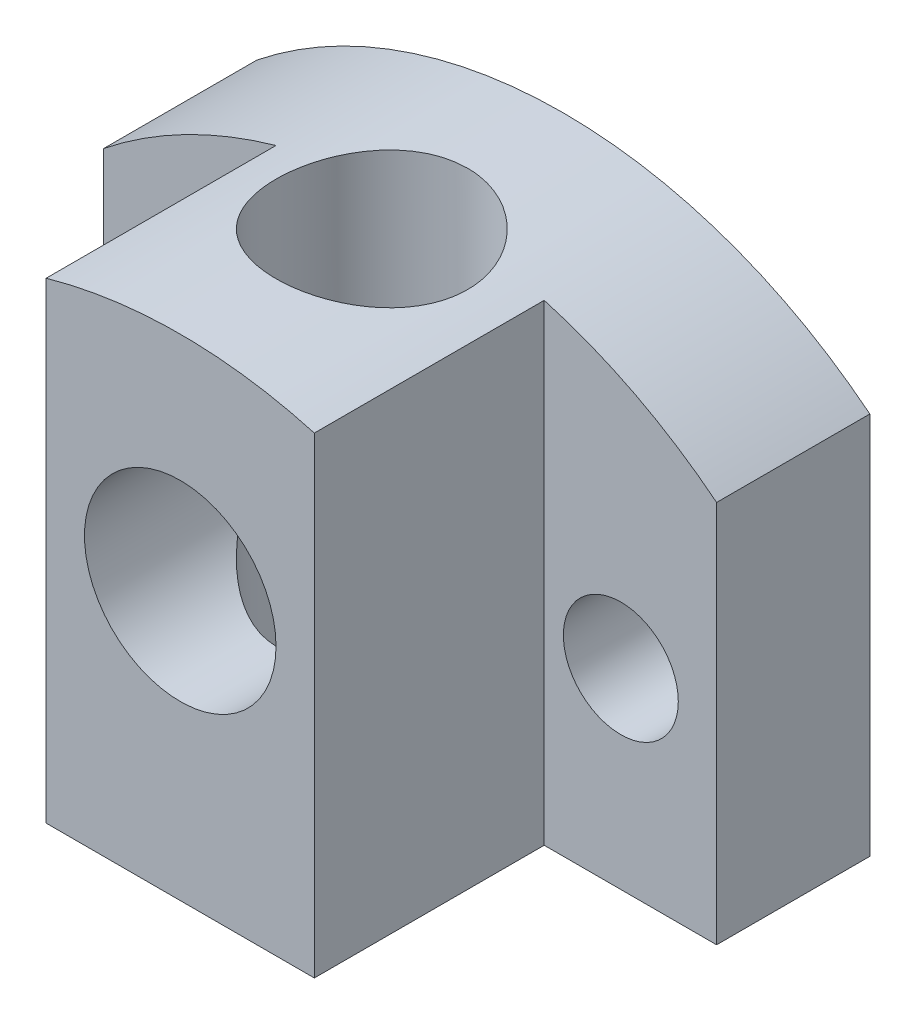
ISO-10303-21;
HEADER;
FILE_DESCRIPTION(('STEP AP214'),'2;1');
FILE_NAME('part.step','',(''),(''),'','','');
FILE_SCHEMA(('AUTOMOTIVE_DESIGN { 1 0 10303 214 1 1 1 1 }'));
ENDSEC;
DATA;
#1=APPLICATION_CONTEXT('core data for automotive mechanical design processes');
#2=APPLICATION_PROTOCOL_DEFINITION('international standard','automotive_design',2000,#1);
#3=PRODUCT_CONTEXT('',#1,'mechanical');
#4=PRODUCT('Part','Part','',(#3));
#5=PRODUCT_RELATED_PRODUCT_CATEGORY('part','',(#4));
#6=PRODUCT_DEFINITION_FORMATION('','',#4);
#7=PRODUCT_DEFINITION_CONTEXT('part definition',#1,'design');
#8=PRODUCT_DEFINITION('design','',#6,#7);
#9=PRODUCT_DEFINITION_SHAPE('','',#8);
#10=(LENGTH_UNIT() NAMED_UNIT(*) SI_UNIT(.MILLI.,.METRE.));
#11=(NAMED_UNIT(*) PLANE_ANGLE_UNIT() SI_UNIT($,.RADIAN.));
#12=(NAMED_UNIT(*) SI_UNIT($,.STERADIAN.) SOLID_ANGLE_UNIT());
#13=UNCERTAINTY_MEASURE_WITH_UNIT(LENGTH_MEASURE(1.E-05),#10,'distance_accuracy_value','');
#14=(GEOMETRIC_REPRESENTATION_CONTEXT(3) GLOBAL_UNCERTAINTY_ASSIGNED_CONTEXT((#13)) GLOBAL_UNIT_ASSIGNED_CONTEXT((#10,
#11,#12)) REPRESENTATION_CONTEXT('',''));
#15=CARTESIAN_POINT('',(0.,0.,0.));
#16=DIRECTION('',(0.,0.,1.));
#17=DIRECTION('',(1.,0.,0.));
#18=AXIS2_PLACEMENT_3D('',#15,#16,#17);
#19=CARTESIAN_POINT('',(0.,0.,-43.4621770797728));
#20=DIRECTION('',(0.,0.,1.));
#21=DIRECTION('',(1.,0.,0.));
#22=AXIS2_PLACEMENT_3D('',#19,#20,#21);
#23=PLANE('',#22);
#24=CARTESIAN_POINT('',(-55.,50.0000000000166,-43.4621770797728));
#25=DIRECTION('',(0.,0.,1.));
#26=DIRECTION('',(1.,0.,0.));
#27=AXIS2_PLACEMENT_3D('',#24,#25,#26);
#28=CIRCLE('',#27,15.);
#29=CARTESIAN_POINT('',(-40.,50.0000000000166,-43.4621770797728));
#30=VERTEX_POINT('',#29);
#31=EDGE_CURVE('E373',#30,#30,#28,.T.);
#32=ORIENTED_EDGE('',*,*,#31,.T.);
#33=EDGE_LOOP('',(#32));
#34=FACE_BOUND('',#33,.T.);
#35=CARTESIAN_POINT('',(0.,70.0000000000166,-43.4621770797728));
#36=DIRECTION('',(0.,0.,1.));
#37=DIRECTION('',(1.,0.,0.));
#38=AXIS2_PLACEMENT_3D('',#35,#36,#37);
#39=CIRCLE('',#38,24.9999999999952);
#40=CARTESIAN_POINT('',(24.9999999999952,70.0000000000166,-43.4621770797728));
#41=VERTEX_POINT('',#40);
#42=EDGE_CURVE('E380',#41,#41,#39,.T.);
#43=ORIENTED_EDGE('',*,*,#42,.T.);
#44=EDGE_LOOP('',(#43));
#45=FACE_BOUND('',#44,.T.);
#46=DIRECTION('',(0.,1.,0.));
#47=VECTOR('',#46,1.);
#48=CARTESIAN_POINT('',(-79.9999999999841,-291432.,-43.4621770797728));
#49=LINE('',#48,#47);
#50=CARTESIAN_POINT('',(-79.9999999999841,1.66206933264434E-11,-43.4621770797728));
#51=VERTEX_POINT('',#50);
#52=CARTESIAN_POINT('',(-79.9999999999792,100.000000000017,-43.4621770797728));
#53=VERTEX_POINT('',#52);
#54=EDGE_CURVE('E136',#51,#53,#49,.T.);
#55=ORIENTED_EDGE('',*,*,#54,.T.);
#56=CARTESIAN_POINT('',(0.,0.,-43.4621770797728));
#57=DIRECTION('',(0.,0.,1.));
#58=DIRECTION('',(1.,0.,0.));
#59=AXIS2_PLACEMENT_3D('',#56,#57,#58);
#60=CIRCLE('',#59,128.062484748657);
#61=CARTESIAN_POINT('',(79.99999999996,100.000000000023,-43.4621770797728));
#62=VERTEX_POINT('',#61);
#63=EDGE_CURVE('E153',#62,#53,#60,.T.);
#64=ORIENTED_EDGE('',*,*,#63,.F.);
#65=DIRECTION('',(0.,1.,0.));
#66=VECTOR('',#65,1.);
#67=CARTESIAN_POINT('',(80.0000000000409,-291432.,-43.4621770797728));
#68=LINE('',#67,#66);
#69=CARTESIAN_POINT('',(79.9999999999841,1.66500848496229E-11,-43.4621770797728));
#70=VERTEX_POINT('',#69);
#71=EDGE_CURVE('E150',#70,#62,#68,.T.);
#72=ORIENTED_EDGE('',*,*,#71,.F.);
#73=DIRECTION('',(1.,0.,0.));
#74=VECTOR('',#73,1.);
#75=CARTESIAN_POINT('',(-400000.,-5.6843418860808E-11,-43.4621770797728));
#76=LINE('',#75,#74);
#77=EDGE_CURVE('E133',#51,#70,#76,.T.);
#78=ORIENTED_EDGE('',*,*,#77,.F.);
#79=EDGE_LOOP('',(#55,#64,#72,#78));
#80=FACE_BOUND('',#79,.T.);
#81=CARTESIAN_POINT('',(55.,50.0000000000166,-43.4621770797728));
#82=DIRECTION('',(0.,0.,-1.));
#83=DIRECTION('',(-1.,0.,0.));
#84=AXIS2_PLACEMENT_3D('',#81,#82,#83);
#85=CIRCLE('',#84,15.);
#86=CARTESIAN_POINT('',(40.,50.0000000000166,-43.4621770797728));
#87=VERTEX_POINT('',#86);
#88=EDGE_CURVE('E374',#87,#87,#85,.T.);
#89=ORIENTED_EDGE('',*,*,#88,.F.);
#90=EDGE_LOOP('',(#89));
#91=FACE_BOUND('',#90,.T.);
#92=ADVANCED_FACE('F35',(#34,#45,#80,#91),#23,.F.);
#93=CARTESIAN_POINT('',(0.,128.063484748657,6.53782292022726));
#94=DIRECTION('',(0.,-1.,0.));
#95=DIRECTION('',(0.,0.,-1.));
#96=AXIS2_PLACEMENT_3D('',#93,#94,#95);
#97=CYLINDRICAL_SURFACE('',#96,25.);
#98=CARTESIAN_POINT('',(0.,70.0000000000166,6.53782292022726));
#99=DIRECTION('',(0.,-0.707106781186547,0.707106781186547));
#100=DIRECTION('',(0.,-0.707106781186547,-0.707106781186547));
#101=AXIS2_PLACEMENT_3D('',#98,#99,#100);
#102=ELLIPSE('',#101,35.355339059324,24.9999999999976);
#103=CARTESIAN_POINT('',(-24.9999999999976,70.0000000000166,6.53782292022726));
#104=VERTEX_POINT('',#103);
#105=CARTESIAN_POINT('',(24.9999999999976,70.0000000000166,6.53782292022726));
#106=VERTEX_POINT('',#105);
#107=EDGE_CURVE('E11',#104,#106,#102,.F.);
#108=ORIENTED_EDGE('',*,*,#107,.F.);
#109=CARTESIAN_POINT('',(0.,70.0000000000166,6.53782292022726));
#110=DIRECTION('',(0.,-0.707106781186547,-0.707106781186547));
#111=DIRECTION('',(0.,-0.707106781186547,0.707106781186547));
#112=AXIS2_PLACEMENT_3D('',#109,#110,#111);
#113=ELLIPSE('',#112,35.355339059324,24.9999999999976);
#114=EDGE_CURVE('E50',#106,#104,#113,.F.);
#115=ORIENTED_EDGE('',*,*,#114,.F.);
#116=EDGE_LOOP('',(#108,#115));
#117=FACE_BOUND('',#116,.T.);
#118=CARTESIAN_POINT('',(0.,128.062484748657,-18.4621770797728));
#119=CARTESIAN_POINT('',(-0.695142082861518,128.062482978419,-18.4621732045668));
#120=CARTESIAN_POINT('',(-1.39037289540682,128.056810158009,-18.4331589718586));
#121=CARTESIAN_POINT('',(-2.77588946733407,128.034271799185,-18.3173154257515));
#122=CARTESIAN_POINT('',(-3.46617434873981,128.017404320987,-18.2304760925474));
#123=CARTESIAN_POINT('',(-4.83729093246203,127.972932342315,-17.9995822454572));
#124=CARTESIAN_POINT('',(-5.51811526521599,127.945319909556,-17.8554854605463));
#125=CARTESIAN_POINT('',(-6.86490655884909,127.880129900468,-17.5112135070664));
#126=CARTESIAN_POINT('',(-7.53087413683484,127.842552738883,-17.3110406724343));
#127=CARTESIAN_POINT('',(-8.84271039499342,127.758514805597,-16.8563630287747));
#128=CARTESIAN_POINT('',(-9.48859731200697,127.712062385543,-16.60190927226));
#129=CARTESIAN_POINT('',(-10.7564948260213,127.611528855701,-16.0404527651775));
#130=CARTESIAN_POINT('',(-11.3785051984394,127.557447674178,-15.7334495204775));
#131=CARTESIAN_POINT('',(-12.5943900989995,127.443141131267,-15.0691485768393));
#132=CARTESIAN_POINT('',(-13.1882671818441,127.382916329336,-14.7118554563253));
#133=CARTESIAN_POINT('',(-14.3439967631095,127.257957141653,-13.9494660351384));
#134=CARTESIAN_POINT('',(-14.9058490258169,127.193222722718,-13.5443693826828));
#135=CARTESIAN_POINT('',(-16.0001316289553,127.060234286875,-12.6841884188186));
#136=CARTESIAN_POINT('',(-16.5321454840914,126.991948172876,-12.2285791541892));
#137=CARTESIAN_POINT('',(-17.556026148482,126.854455297319,-11.274410227961));
#138=CARTESIAN_POINT('',(-18.0478926424083,126.785248528536,-10.7758502290788));
#139=CARTESIAN_POINT('',(-18.9881787450439,126.647838135764,-9.73911893206214));
#140=CARTESIAN_POINT('',(-19.4365951672711,126.579634585659,-9.20094473384059));
#141=CARTESIAN_POINT('',(-20.286857549835,126.446149286729,-8.08864125804648));
#142=CARTESIAN_POINT('',(-20.6887033785642,126.38086754616,-7.51451187887222));
#143=CARTESIAN_POINT('',(-21.4462686778638,126.254530096283,-6.32905783958681));
#144=CARTESIAN_POINT('',(-21.8015587555404,126.193515860265,-5.71745422719115));
#145=CARTESIAN_POINT('',(-22.4592767301321,126.078120361726,-4.46584320392627));
#146=CARTESIAN_POINT('',(-22.7617042341733,126.023739148502,-3.82583558200312));
#147=CARTESIAN_POINT('',(-23.3113842249958,125.923220586728,-2.52197140749639));
#148=CARTESIAN_POINT('',(-23.5586407360225,125.877082636953,-1.85811659846188));
#149=CARTESIAN_POINT('',(-23.9960726685231,125.794427933921,-0.511276667932535));
#150=CARTESIAN_POINT('',(-24.1862488989453,125.757911044315,0.171708182299098));
#151=CARTESIAN_POINT('',(-24.5059839235942,125.695994207394,1.54319203448165));
#152=CARTESIAN_POINT('',(-24.636271089232,125.670460936754,2.23151524411565));
#153=CARTESIAN_POINT('',(-24.8386557959202,125.630616676781,3.61698664391357));
#154=CARTESIAN_POINT('',(-24.9107537744733,125.616305603073,4.31413476768621));
#155=CARTESIAN_POINT('',(-24.9961707955821,125.599336584983,5.71210457939389));
#156=CARTESIAN_POINT('',(-25.0094948616772,125.596677644667,6.41292594824177));
#157=CARTESIAN_POINT('',(-24.9772683408429,125.603090477354,7.81315656380167));
#158=CARTESIAN_POINT('',(-24.9317182217551,125.61216215714,8.51256582169075));
#159=CARTESIAN_POINT('',(-24.7831925981942,125.641549545886,9.8948473271222));
#160=CARTESIAN_POINT('',(-24.6810508564899,125.661701970581,10.5778128368491));
#161=CARTESIAN_POINT('',(-24.4207383803839,125.712549482808,11.9325716718318));
#162=CARTESIAN_POINT('',(-24.2625682639061,125.743244454069,12.6043651202161));
#163=CARTESIAN_POINT('',(-23.8914100996149,125.814292439109,13.9321264502291));
#164=CARTESIAN_POINT('',(-23.6784203236259,125.854645757363,14.5880938322318));
#165=CARTESIAN_POINT('',(-23.1992223544499,125.943858243269,15.8796943991677));
#166=CARTESIAN_POINT('',(-22.9330136351488,125.992717495009,16.515327383006));
#167=CARTESIAN_POINT('',(-22.3474344236412,126.097903168625,17.7660026798394));
#168=CARTESIAN_POINT('',(-22.0277320139128,126.154275734697,18.3808856817457));
#169=CARTESIAN_POINT('',(-21.33867673783,126.272653478459,19.5815958751439));
#170=CARTESIAN_POINT('',(-20.9693237446488,126.334658670538,20.1674229924105));
#171=CARTESIAN_POINT('',(-20.1835012960738,126.462582198814,21.3061979725471));
#172=CARTESIAN_POINT('',(-19.7670274983472,126.528500895386,21.859142798034));
#173=CARTESIAN_POINT('',(-18.8898171568486,126.662431725247,22.9284623212855));
#174=CARTESIAN_POINT('',(-18.4290800936583,126.730443883096,23.4448365897805));
#175=CARTESIAN_POINT('',(-17.4581593027275,126.867872584864,24.4461246787433));
#176=CARTESIAN_POINT('',(-16.9472635873703,126.937293224142,24.9303478196962));
#177=CARTESIAN_POINT('',(-15.8863366761298,127.074428343463,25.854112557109));
#178=CARTESIAN_POINT('',(-15.3363050136345,127.142142803151,26.2936536206792));
#179=CARTESIAN_POINT('',(-14.2008397778708,127.273967296325,27.1249851375913));
#180=CARTESIAN_POINT('',(-13.6154055749307,127.338077265663,27.5167747412489));
#181=CARTESIAN_POINT('',(-12.4131504397087,127.460891083495,28.24978666438));
#182=CARTESIAN_POINT('',(-11.7963296431051,127.519594955356,28.5910092024205));
#183=CARTESIAN_POINT('',(-10.5346490231888,127.630022705466,29.2208344293476));
#184=CARTESIAN_POINT('',(-9.88974978693469,127.681736324803,29.5093599933413));
#185=CARTESIAN_POINT('',(-8.57729359898651,127.77661313472,30.0309854435001));
#186=CARTESIAN_POINT('',(-7.90973658068292,127.819776300161,30.2640851667079));
#187=CARTESIAN_POINT('',(-6.55682080978695,127.896313763854,30.6730140290131));
#188=CARTESIAN_POINT('',(-5.87146373711444,127.929688982237,30.8488485515871));
#189=CARTESIAN_POINT('',(-4.48789378799971,127.985694907965,31.1418635943263));
#190=CARTESIAN_POINT('',(-3.78968109999598,128.00832577267,31.2590449735248));
#191=CARTESIAN_POINT('',(-2.39678381821483,128.041918861153,31.432402574303));
#192=CARTESIAN_POINT('',(-1.7022209990307,128.053061687836,31.4895233008756));
#193=CARTESIAN_POINT('',(-0.310665193128561,128.063998050827,31.5455890016789));
#194=CARTESIAN_POINT('',(0.386327767693641,128.063791707704,31.5445345939459));
#195=CARTESIAN_POINT('',(1.77766053277306,128.052035906764,31.4842608432675));
#196=CARTESIAN_POINT('',(2.47200046824215,128.040487017406,31.4250444152478));
#197=CARTESIAN_POINT('',(3.85304846478161,128.006371498756,31.2489255500687));
#198=CARTESIAN_POINT('',(4.53975653985763,127.983804889687,31.13202321879));
#199=CARTESIAN_POINT('',(5.89480186659541,127.928523894682,30.8427026332368));
#200=CARTESIAN_POINT('',(6.56324597582421,127.895897901422,30.6707674740747));
#201=CARTESIAN_POINT('',(7.88315548645323,127.821331640882,30.2724194019364));
#202=CARTESIAN_POINT('',(8.53462101601188,127.77939144393,30.0460069003006));
#203=CARTESIAN_POINT('',(9.81616314911559,127.687335784598,29.54037663083));
#204=CARTESIAN_POINT('',(10.446238588142,127.637219877975,29.2611559934367));
#205=CARTESIAN_POINT('',(11.6807397391199,127.530169947033,28.65193881666));
#206=CARTESIAN_POINT('',(12.28516513957,127.473235839944,28.3219416608568));
#207=CARTESIAN_POINT('',(13.4712893378523,127.353381886924,27.6093352889114));
#208=CARTESIAN_POINT('',(14.0526383035739,127.290399651372,27.226154235938));
#209=CARTESIAN_POINT('',(15.18110089043,127.160751835001,26.4128801801415));
#210=CARTESIAN_POINT('',(15.7282142832161,127.09408622962,25.9827868644699));
#211=CARTESIAN_POINT('',(16.7846157755035,126.958892265289,25.0785915814902));
#212=CARTESIAN_POINT('',(17.293900491175,126.890363740445,24.6044856857067));
#213=CARTESIAN_POINT('',(18.2712005282584,126.753330424187,23.6154852937749));
#214=CARTESIAN_POINT('',(18.7392155094141,126.684825632974,23.1005904614009));
#215=CARTESIAN_POINT('',(19.6372884640126,126.548750314769,22.0257034811798));
#216=CARTESIAN_POINT('',(20.0666983758884,126.481207697208,21.4651660977242));
#217=CARTESIAN_POINT('',(20.8767747624981,126.350024565292,20.3094694003178));
#218=CARTESIAN_POINT('',(21.2574407042479,126.286384093608,19.7143097078976));
#219=CARTESIAN_POINT('',(21.9672655247039,126.164848368064,18.493482308751));
#220=CARTESIAN_POINT('',(22.2964256896729,126.106952970745,17.8678153643995));
#221=CARTESIAN_POINT('',(22.9007970142529,125.998602421953,16.5903247143801));
#222=CARTESIAN_POINT('',(23.1760086844594,125.948147200065,15.9385012563409));
#223=CARTESIAN_POINT('',(23.6691102938166,125.85640960745,14.6166995267246));
#224=CARTESIAN_POINT('',(23.8872857851738,125.815081708816,13.9468309668389));
#225=CARTESIAN_POINT('',(24.2664418872206,125.742503172393,12.5905573779477));
#226=CARTESIAN_POINT('',(24.4274226026042,125.711252516157,11.9041523792144));
#227=CARTESIAN_POINT('',(24.6908824575003,125.659772281882,10.5198680808322));
#228=CARTESIAN_POINT('',(24.7933676683401,125.639541560079,9.82198997973021));
#229=CARTESIAN_POINT('',(24.9390220791946,125.610710997051,8.41983530009437));
#230=CARTESIAN_POINT('',(24.9821920751776,125.602110999749,7.71555880755004));
#231=CARTESIAN_POINT('',(25.0086321665234,125.59684897522,6.31802196375232));
#232=CARTESIAN_POINT('',(24.9929242291417,125.599983270174,5.62478150093845));
#233=CARTESIAN_POINT('',(24.9040111202498,125.617643186957,4.24215077503492));
#234=CARTESIAN_POINT('',(24.8308066513228,125.63216866959,3.5527604650017));
#235=CARTESIAN_POINT('',(24.627484616446,125.672183510935,2.18276106639661));
#236=CARTESIAN_POINT('',(24.497367770697,125.697672730904,1.50215186681588));
#237=CARTESIAN_POINT('',(24.1812400267828,125.75887051845,0.154512280895691));
#238=CARTESIAN_POINT('',(23.9952289050615,125.7945791269,-0.512518051122019));
#239=CARTESIAN_POINT('',(23.5692117331955,125.87509323595,-1.82689332777808));
#240=CARTESIAN_POINT('',(23.3293263224673,125.919878390124,-2.47427864202096));
#241=CARTESIAN_POINT('',(22.7971103652983,126.017319813118,-3.74649587181602));
#242=CARTESIAN_POINT('',(22.5047799931876,126.069976055774,-4.37132786232842));
#243=CARTESIAN_POINT('',(21.8697601951362,126.181684361097,-5.59429759628093));
#244=CARTESIAN_POINT('',(21.5270678052839,126.240736800139,-6.19243376591242));
#245=CARTESIAN_POINT('',(20.7937306265868,126.363598119301,-7.35803577101011));
#246=CARTESIAN_POINT('',(20.4030852166027,126.427407061026,-7.92550120905864));
#247=CARTESIAN_POINT('',(19.5697946478961,126.55909241925,-9.03498118741421));
#248=CARTESIAN_POINT('',(19.1264091875612,126.627018004505,-9.57643402203034));
#249=CARTESIAN_POINT('',(18.195906958225,126.7640724417,-10.6202016570372));
#250=CARTESIAN_POINT('',(17.7087896227022,126.833201309219,-11.1225159502529));
#251=CARTESIAN_POINT('',(16.6940070709322,126.970753702688,-12.0847209459184));
#252=CARTESIAN_POINT('',(16.1663325684871,127.039177063009,-12.5446018792278));
#253=CARTESIAN_POINT('',(15.074089664128,127.173403307696,-13.4186561933114));
#254=CARTESIAN_POINT('',(14.5095215549789,127.23920621285,-13.8328299367195));
#255=CARTESIAN_POINT('',(13.3415339964156,127.366997043688,-14.6164414702955));
#256=CARTESIAN_POINT('',(12.7377854359387,127.428940785732,-14.9853961330541));
#257=CARTESIAN_POINT('',(11.5006794340928,127.546541997882,-15.6710608886155));
#258=CARTESIAN_POINT('',(10.8673203965653,127.602199128553,-15.9877681608355));
#259=CARTESIAN_POINT('',(9.57602886738111,127.705594468027,-16.566285440556));
#260=CARTESIAN_POINT('',(8.91811727188679,127.753339230701,-16.8281409301267));
#261=CARTESIAN_POINT('',(7.58198505244395,127.839592250986,-17.2952240596998));
#262=CARTESIAN_POINT('',(6.90376843954579,127.878102319451,-17.5004628030102));
#263=CARTESIAN_POINT('',(5.71109637837278,127.93608236875,-17.8067317103974));
#264=CARTESIAN_POINT('',(5.20010412767637,127.957898445359,-17.9209791825774));
#265=CARTESIAN_POINT('',(4.17162841662563,127.995555583083,-18.1172287160645));
#266=CARTESIAN_POINT('',(3.65414386904109,128.011395629243,-18.1992253000549));
#267=CARTESIAN_POINT('',(2.61490617906372,128.036840083333,-18.3305621455182));
#268=CARTESIAN_POINT('',(2.09315313320264,128.046444631885,-18.3799031434391));
#269=CARTESIAN_POINT('',(1.04761660383266,128.059267068247,-18.4457091710657));
#270=CARTESIAN_POINT('',(0.523833494824608,128.062486082643,-18.4621799999853));
#271=CARTESIAN_POINT('',(0.,128.062484748657,-18.4621770797728));
#272=B_SPLINE_CURVE_WITH_KNOTS('',3,(#118,#119,#120,#121,#122,#123,#124,#125,#126,#127,#128,
#129,#130,#131,#132,#133,#134,#135,#136,#137,#138,#139,#140,#141,#142,#143,#144,#145,#146,#147,
#148,#149,#150,#151,#152,#153,#154,#155,#156,#157,#158,#159,#160,#161,#162,#163,#164,#165,#166,
#167,#168,#169,#170,#171,#172,#173,#174,#175,#176,#177,#178,#179,#180,#181,#182,#183,#184,#185,
#186,#187,#188,#189,#190,#191,#192,#193,#194,#195,#196,#197,#198,#199,#200,#201,#202,#203,#204,
#205,#206,#207,#208,#209,#210,#211,#212,#213,#214,#215,#216,#217,#218,#219,#220,#221,#222,#223,
#224,#225,#226,#227,#228,#229,#230,#231,#232,#233,#234,#235,#236,#237,#238,#239,#240,#241,#242,
#243,#244,#245,#246,#247,#248,#249,#250,#251,#252,#253,#254,#255,#256,#257,#258,#259,#260,#261,
#262,#263,#264,#265,#266,#267,#268,#269,#270,#271),.UNSPECIFIED.,.T.,.F.,(4,2,2,2,2,2,2,2,2,2,2,
2,2,2,2,2,2,2,2,2,2,2,2,2,2,2,2,2,2,2,2,2,2,2,2,2,2,2,2,2,2,2,2,2,2,2,2,2,2,2,2,2,2,2,2,2,2,2,2,
2,2,2,2,2,2,2,2,2,2,2,2,2,2,2,2,2,4),(0.,2.08495327265668,4.17026791543519,6.2571249365198,
8.34389511359422,10.428711218804,12.5135469289838,14.5981929569347,16.6828543265982,
18.7916775437422,20.900517322554,23.0095116397188,25.1185119167214,27.2457682683457,
29.3730404290413,31.5001573729232,33.6272441696284,35.7277283499506,37.8281967373671,
39.9284855895094,42.0287577518887,44.0988792547329,46.1689779273976,48.2391418673772,
50.3093262736842,52.392867492327,54.476414033244,56.5601527362616,58.6439158944091,
60.7633840377755,62.8828774554851,65.0024085817276,67.1219305464156,69.2445301151607,
71.3671359244776,73.4895421309047,75.6119172516839,77.7003929020841,79.7888463651071,
81.8771951657432,83.9655401332985,86.0360338137829,88.1065118611517,90.1771024492463,
92.2477181760016,94.3426269613008,96.4375497179795,98.5326596434183,100.627786840777,
102.753264299852,104.878764997683,107.004212606537,109.129640098121,111.244213497634,
113.358783026434,115.473133041281,117.587454682769,119.665248539889,121.743017007645,
123.820759182922,125.898509668496,127.9716530839,130.044789608186,132.118048189856,
134.191333629449,136.298228779899,138.405151227915,140.512557534177,142.619947119389,
144.74818585984,146.876539455987,149.003121213687,151.12928562303,152.70047567062,
154.27193244554,155.843353779796,157.414497847015),.UNSPECIFIED.);
#273=CARTESIAN_POINT('',(0.,128.062484748657,-18.4621770797728));
#274=VERTEX_POINT('',#273);
#275=EDGE_CURVE('E174',#274,#274,#272,.T.);
#276=ORIENTED_EDGE('',*,*,#275,.T.);
#277=EDGE_LOOP('',(#276));
#278=FACE_BOUND('',#277,.T.);
#279=ADVANCED_FACE('F118',(#117,#278),#97,.F.);
#280=CARTESIAN_POINT('',(0.,0.,-43.4621770797728));
#281=DIRECTION('',(0.,0.,1.));
#282=DIRECTION('',(1.,0.,0.));
#283=AXIS2_PLACEMENT_3D('',#280,#281,#282);
#284=CYLINDRICAL_SURFACE('',#283,128.062484748657);
#285=CARTESIAN_POINT('',(0.,0.,-3.46217707977275));
#286=DIRECTION('',(0.,0.,1.));
#287=DIRECTION('',(1.,0.,0.));
#288=AXIS2_PLACEMENT_3D('',#285,#286,#287);
#289=CIRCLE('',#288,128.062484748657);
#290=CARTESIAN_POINT('',(79.99999999996,100.000000000023,-3.46217707977275));
#291=VERTEX_POINT('',#290);
#292=CARTESIAN_POINT('',(35.,123.186849947545,-3.46217707977275));
#293=VERTEX_POINT('',#292);
#294=EDGE_CURVE('E141',#291,#293,#289,.T.);
#295=ORIENTED_EDGE('',*,*,#294,.F.);
#296=DIRECTION('',(0.,0.,1.));
#297=VECTOR('',#296,1.);
#298=CARTESIAN_POINT('',(79.99999999996,100.000000000023,-43.4621770797728));
#299=LINE('',#298,#297);
#300=EDGE_CURVE('E126',#62,#291,#299,.T.);
#301=ORIENTED_EDGE('',*,*,#300,.F.);
#302=ORIENTED_EDGE('',*,*,#63,.T.);
#303=DIRECTION('',(0.,0.,1.));
#304=VECTOR('',#303,1.);
#305=CARTESIAN_POINT('',(-79.9999999999792,100.000000000017,-43.4621770797728));
#306=LINE('',#305,#304);
#307=CARTESIAN_POINT('',(-79.9999999999792,100.000000000017,-3.46217707977275));
#308=VERTEX_POINT('',#307);
#309=EDGE_CURVE('E116',#53,#308,#306,.T.);
#310=ORIENTED_EDGE('',*,*,#309,.T.);
#311=CARTESIAN_POINT('',(-35.,123.186849947549,-3.46217707977275));
#312=VERTEX_POINT('',#311);
#313=EDGE_CURVE('E143',#312,#308,#289,.T.);
#314=ORIENTED_EDGE('',*,*,#313,.F.);
#315=DIRECTION('',(0.,0.,-1.));
#316=VECTOR('',#315,1.);
#317=CARTESIAN_POINT('',(-35.,123.186849947545,56.5378229202272));
#318=LINE('',#317,#316);
#319=CARTESIAN_POINT('',(-35.,123.186849947545,56.5378229202272));
#320=VERTEX_POINT('',#319);
#321=EDGE_CURVE('E162',#320,#312,#318,.T.);
#322=ORIENTED_EDGE('',*,*,#321,.F.);
#323=CARTESIAN_POINT('',(0.,0.,56.5378229202272));
#324=DIRECTION('',(0.,0.,1.));
#325=DIRECTION('',(1.,0.,0.));
#326=AXIS2_PLACEMENT_3D('',#323,#324,#325);
#327=CIRCLE('',#326,128.062484748653);
#328=CARTESIAN_POINT('',(35.,123.186849947545,56.5378229202272));
#329=VERTEX_POINT('',#328);
#330=EDGE_CURVE('E176',#329,#320,#327,.T.);
#331=ORIENTED_EDGE('',*,*,#330,.F.);
#332=DIRECTION('',(0.,0.,-1.));
#333=VECTOR('',#332,1.);
#334=CARTESIAN_POINT('',(35.,123.186849947545,56.5378229202272));
#335=LINE('',#334,#333);
#336=EDGE_CURVE('E159',#329,#293,#335,.T.);
#337=ORIENTED_EDGE('',*,*,#336,.T.);
#338=EDGE_LOOP('',(#295,#301,#302,#310,#314,#322,#331,#337));
#339=FACE_BOUND('',#338,.T.);
#340=ORIENTED_EDGE('',*,*,#275,.F.);
#341=EDGE_LOOP('',(#340));
#342=FACE_BOUND('',#341,.T.);
#343=ADVANCED_FACE('F222',(#339,#342),#284,.T.);
#344=CARTESIAN_POINT('',(0.,0.,-3.46217707977275));
#345=DIRECTION('',(0.,0.,1.));
#346=DIRECTION('',(1.,0.,0.));
#347=AXIS2_PLACEMENT_3D('',#344,#345,#346);
#348=PLANE('',#347);
#349=CARTESIAN_POINT('',(-55.,50.0000000000166,-3.46217707977275));
#350=DIRECTION('',(0.,0.,1.));
#351=DIRECTION('',(1.,0.,0.));
#352=AXIS2_PLACEMENT_3D('',#349,#350,#351);
#353=CIRCLE('',#352,15.);
#354=CARTESIAN_POINT('',(-40.,50.0000000000166,-3.46217707977275));
#355=VERTEX_POINT('',#354);
#356=EDGE_CURVE('E370',#355,#355,#353,.T.);
#357=ORIENTED_EDGE('',*,*,#356,.F.);
#358=EDGE_LOOP('',(#357));
#359=FACE_BOUND('',#358,.T.);
#360=DIRECTION('',(0.,-1.,0.));
#361=VECTOR('',#360,1.);
#362=CARTESIAN_POINT('',(-35.,0.,-3.46217707977275));
#363=LINE('',#362,#361);
#364=CARTESIAN_POINT('',(-35.000000000025,1.66289596923377E-11,-3.46217707977275));
#365=VERTEX_POINT('',#364);
#366=EDGE_CURVE('E58',#312,#365,#363,.T.);
#367=ORIENTED_EDGE('',*,*,#366,.F.);
#368=ORIENTED_EDGE('',*,*,#313,.T.);
#369=DIRECTION('',(0.,1.,0.));
#370=VECTOR('',#369,1.);
#371=CARTESIAN_POINT('',(-79.9999999999841,-291432.,-3.46217707977275));
#372=LINE('',#371,#370);
#373=CARTESIAN_POINT('',(-79.9999999999841,1.66206933264434E-11,-3.46217707977275));
#374=VERTEX_POINT('',#373);
#375=EDGE_CURVE('E144',#374,#308,#372,.T.);
#376=ORIENTED_EDGE('',*,*,#375,.F.);
#377=DIRECTION('',(1.,0.,0.));
#378=VECTOR('',#377,1.);
#379=CARTESIAN_POINT('',(-400000.,-5.6843418860808E-11,-3.46217707977275));
#380=LINE('',#379,#378);
#381=EDGE_CURVE('E134',#374,#365,#380,.T.);
#382=ORIENTED_EDGE('',*,*,#381,.T.);
#383=EDGE_LOOP('',(#367,#368,#376,#382));
#384=FACE_BOUND('',#383,.T.);
#385=ADVANCED_FACE('F215',(#359,#384),#348,.T.);
#386=CARTESIAN_POINT('',(-79.9999999999841,-291432.,-43.4621770797728));
#387=DIRECTION('',(1.,0.,0.));
#388=DIRECTION('',(0.,0.,-1.));
#389=AXIS2_PLACEMENT_3D('',#386,#387,#388);
#390=PLANE('',#389);
#391=ORIENTED_EDGE('',*,*,#375,.T.);
#392=ORIENTED_EDGE('',*,*,#309,.F.);
#393=ORIENTED_EDGE('',*,*,#54,.F.);
#394=DIRECTION('',(0.,0.,1.));
#395=VECTOR('',#394,1.);
#396=CARTESIAN_POINT('',(-79.9999999999841,1.66206933264434E-11,-43.4621770797728));
#397=LINE('',#396,#395);
#398=EDGE_CURVE('E131',#51,#374,#397,.T.);
#399=ORIENTED_EDGE('',*,*,#398,.T.);
#400=EDGE_LOOP('',(#391,#392,#393,#399));
#401=FACE_BOUND('',#400,.T.);
#402=ADVANCED_FACE('F37',(#401),#390,.F.);
#403=CARTESIAN_POINT('',(80.0000000000409,-291432.,-43.4621770797728));
#404=DIRECTION('',(1.,0.,0.));
#405=DIRECTION('',(0.,1.,0.));
#406=AXIS2_PLACEMENT_3D('',#403,#404,#405);
#407=PLANE('',#406);
#408=DIRECTION('',(0.,1.,0.));
#409=VECTOR('',#408,1.);
#410=CARTESIAN_POINT('',(80.0000000000409,-291432.,-3.46217707977275));
#411=LINE('',#410,#409);
#412=CARTESIAN_POINT('',(79.9999999999841,1.66500848496229E-11,-3.46217707977275));
#413=VERTEX_POINT('',#412);
#414=EDGE_CURVE('E138',#413,#291,#411,.T.);
#415=ORIENTED_EDGE('',*,*,#414,.F.);
#416=DIRECTION('',(0.,0.,1.));
#417=VECTOR('',#416,1.);
#418=CARTESIAN_POINT('',(79.9999999999841,1.66500848496229E-11,-43.4621770797728));
#419=LINE('',#418,#417);
#420=EDGE_CURVE('E128',#70,#413,#419,.T.);
#421=ORIENTED_EDGE('',*,*,#420,.F.);
#422=ORIENTED_EDGE('',*,*,#71,.T.);
#423=ORIENTED_EDGE('',*,*,#300,.T.);
#424=EDGE_LOOP('',(#415,#421,#422,#423));
#425=FACE_BOUND('',#424,.T.);
#426=ADVANCED_FACE('F218',(#425),#407,.T.);
#427=CARTESIAN_POINT('',(-400000.,-5.6843418860808E-11,-43.4621770797728));
#428=DIRECTION('',(0.,-1.,0.));
#429=DIRECTION('',(1.,0.,0.));
#430=AXIS2_PLACEMENT_3D('',#427,#428,#429);
#431=PLANE('',#430);
#432=CARTESIAN_POINT('',(0.,0.,6.53782292022726));
#433=DIRECTION('',(0.,1.,0.));
#434=DIRECTION('',(0.,0.,1.));
#435=AXIS2_PLACEMENT_3D('',#432,#433,#434);
#436=CIRCLE('',#435,25.);
#437=CARTESIAN_POINT('',(0.,0.,31.5378229202273));
#438=VERTEX_POINT('',#437);
#439=EDGE_CURVE('E189',#438,#438,#436,.T.);
#440=ORIENTED_EDGE('',*,*,#439,.T.);
#441=EDGE_LOOP('',(#440));
#442=FACE_BOUND('',#441,.T.);
#443=ORIENTED_EDGE('',*,*,#381,.F.);
#444=ORIENTED_EDGE('',*,*,#398,.F.);
#445=ORIENTED_EDGE('',*,*,#77,.T.);
#446=ORIENTED_EDGE('',*,*,#420,.T.);
#447=CARTESIAN_POINT('',(35.000000000025,1.66418184837287E-11,-3.46217707977275));
#448=VERTEX_POINT('',#447);
#449=EDGE_CURVE('E137',#448,#413,#380,.T.);
#450=ORIENTED_EDGE('',*,*,#449,.F.);
#451=DIRECTION('',(0.,0.,-1.));
#452=VECTOR('',#451,1.);
#453=CARTESIAN_POINT('',(35.,0.,56.5378229202272));
#454=LINE('',#453,#452);
#455=CARTESIAN_POINT('',(35.,0.,56.5378229202272));
#456=VERTEX_POINT('',#455);
#457=EDGE_CURVE('E147',#456,#448,#454,.T.);
#458=ORIENTED_EDGE('',*,*,#457,.F.);
#459=DIRECTION('',(1.,0.,0.));
#460=VECTOR('',#459,1.);
#461=CARTESIAN_POINT('',(35.,0.,56.5378229202272));
#462=LINE('',#461,#460);
#463=CARTESIAN_POINT('',(-35.,0.,56.5378229202272));
#464=VERTEX_POINT('',#463);
#465=EDGE_CURVE('E170',#464,#456,#462,.T.);
#466=ORIENTED_EDGE('',*,*,#465,.F.);
#467=DIRECTION('',(0.,0.,-1.));
#468=VECTOR('',#467,1.);
#469=CARTESIAN_POINT('',(-35.,0.,56.5378229202272));
#470=LINE('',#469,#468);
#471=EDGE_CURVE('E165',#464,#365,#470,.T.);
#472=ORIENTED_EDGE('',*,*,#471,.T.);
#473=EDGE_LOOP('',(#443,#444,#445,#446,#450,#458,#466,#472));
#474=FACE_BOUND('',#473,.T.);
#475=ADVANCED_FACE('F213',(#442,#474),#431,.T.);
#476=CARTESIAN_POINT('',(55.,50.0000000000166,-3.46217707977275));
#477=DIRECTION('',(0.,0.,1.));
#478=DIRECTION('',(1.,0.,0.));
#479=AXIS2_PLACEMENT_3D('',#476,#477,#478);
#480=CIRCLE('',#479,15.);
#481=CARTESIAN_POINT('',(70.,50.0000000000166,-3.46217707977275));
#482=VERTEX_POINT('',#481);
#483=EDGE_CURVE('E39',#482,#482,#480,.F.);
#484=ORIENTED_EDGE('',*,*,#483,.T.);
#485=EDGE_LOOP('',(#484));
#486=FACE_BOUND('',#485,.T.);
#487=DIRECTION('',(0.,1.,0.));
#488=VECTOR('',#487,1.);
#489=CARTESIAN_POINT('',(34.9999999999999,123.186849947545,-3.46217707977275));
#490=LINE('',#489,#488);
#491=EDGE_CURVE('E171',#448,#293,#490,.T.);
#492=ORIENTED_EDGE('',*,*,#491,.F.);
#493=ORIENTED_EDGE('',*,*,#449,.T.);
#494=ORIENTED_EDGE('',*,*,#414,.T.);
#495=ORIENTED_EDGE('',*,*,#294,.T.);
#496=EDGE_LOOP('',(#492,#493,#494,#495));
#497=FACE_BOUND('',#496,.T.);
#498=ADVANCED_FACE('F206',(#486,#497),#348,.T.);
#499=CARTESIAN_POINT('',(34.9999999999999,123.186849947545,56.5378229202272));
#500=DIRECTION('',(-1.,0.,0.));
#501=DIRECTION('',(0.,-1.,0.));
#502=AXIS2_PLACEMENT_3D('',#499,#500,#501);
#503=PLANE('',#502);
#504=ORIENTED_EDGE('',*,*,#491,.T.);
#505=ORIENTED_EDGE('',*,*,#336,.F.);
#506=DIRECTION('',(0.,1.,0.));
#507=VECTOR('',#506,1.);
#508=CARTESIAN_POINT('',(34.9999999999999,123.186849947545,56.5378229202272));
#509=LINE('',#508,#507);
#510=EDGE_CURVE('E178',#456,#329,#509,.T.);
#511=ORIENTED_EDGE('',*,*,#510,.F.);
#512=ORIENTED_EDGE('',*,*,#457,.T.);
#513=EDGE_LOOP('',(#504,#505,#511,#512));
#514=FACE_BOUND('',#513,.T.);
#515=ADVANCED_FACE('F202',(#514),#503,.F.);
#516=CARTESIAN_POINT('',(-35.,0.,56.5378229202272));
#517=DIRECTION('',(1.,0.,0.));
#518=DIRECTION('',(0.,0.,-1.));
#519=AXIS2_PLACEMENT_3D('',#516,#517,#518);
#520=PLANE('',#519);
#521=ORIENTED_EDGE('',*,*,#366,.T.);
#522=ORIENTED_EDGE('',*,*,#471,.F.);
#523=DIRECTION('',(0.,-1.,0.));
#524=VECTOR('',#523,1.);
#525=CARTESIAN_POINT('',(-35.,0.,56.5378229202272));
#526=LINE('',#525,#524);
#527=EDGE_CURVE('E168',#320,#464,#526,.T.);
#528=ORIENTED_EDGE('',*,*,#527,.F.);
#529=ORIENTED_EDGE('',*,*,#321,.T.);
#530=EDGE_LOOP('',(#521,#522,#528,#529));
#531=FACE_BOUND('',#530,.T.);
#532=ADVANCED_FACE('F198',(#531),#520,.F.);
#533=CARTESIAN_POINT('',(0.,0.,56.5378229202272));
#534=DIRECTION('',(0.,0.,1.));
#535=DIRECTION('',(1.,0.,0.));
#536=AXIS2_PLACEMENT_3D('',#533,#534,#535);
#537=PLANE('',#536);
#538=CARTESIAN_POINT('',(0.,70.0000000000166,56.5378229202272));
#539=DIRECTION('',(0.,0.,1.));
#540=DIRECTION('',(1.,0.,0.));
#541=AXIS2_PLACEMENT_3D('',#538,#539,#540);
#542=CIRCLE('',#541,24.9999999999952);
#543=CARTESIAN_POINT('',(24.9999999999952,70.0000000000166,56.5378229202272));
#544=VERTEX_POINT('',#543);
#545=EDGE_CURVE('E375',#544,#544,#542,.T.);
#546=ORIENTED_EDGE('',*,*,#545,.F.);
#547=EDGE_LOOP('',(#546));
#548=FACE_BOUND('',#547,.T.);
#549=ORIENTED_EDGE('',*,*,#465,.T.);
#550=ORIENTED_EDGE('',*,*,#510,.T.);
#551=ORIENTED_EDGE('',*,*,#330,.T.);
#552=ORIENTED_EDGE('',*,*,#527,.T.);
#553=EDGE_LOOP('',(#549,#550,#551,#552));
#554=FACE_BOUND('',#553,.T.);
#555=ADVANCED_FACE('F195',(#548,#554),#537,.T.);
#556=CARTESIAN_POINT('',(0.,70.0000000000166,6.53782292022726));
#557=DIRECTION('',(0.,-0.707106781186547,0.707106781186547));
#558=DIRECTION('',(0.,-0.707106781186547,-0.707106781186547));
#559=AXIS2_PLACEMENT_3D('',#556,#557,#558);
#560=ELLIPSE('',#559,35.355339059324,24.9999999999976);
#561=EDGE_CURVE('E44',#104,#106,#560,.T.);
#562=ORIENTED_EDGE('',*,*,#561,.F.);
#563=CARTESIAN_POINT('',(0.,70.0000000000166,6.53782292022726));
#564=DIRECTION('',(0.,-0.707106781186547,-0.707106781186547));
#565=DIRECTION('',(0.,-0.707106781186547,0.707106781186547));
#566=AXIS2_PLACEMENT_3D('',#563,#564,#565);
#567=ELLIPSE('',#566,35.355339059324,24.9999999999976);
#568=EDGE_CURVE('E107',#106,#104,#567,.T.);
#569=ORIENTED_EDGE('',*,*,#568,.F.);
#570=EDGE_LOOP('',(#562,#569));
#571=FACE_BOUND('',#570,.T.);
#572=ORIENTED_EDGE('',*,*,#439,.F.);
#573=EDGE_LOOP('',(#572));
#574=FACE_BOUND('',#573,.T.);
#575=ADVANCED_FACE('F120',(#571,#574),#97,.F.);
#576=CARTESIAN_POINT('',(0.,70.0000000000166,-43.4621770797728));
#577=DIRECTION('',(0.,0.,1.));
#578=DIRECTION('',(1.,0.,0.));
#579=AXIS2_PLACEMENT_3D('',#576,#577,#578);
#580=CYLINDRICAL_SURFACE('',#579,24.9999999999952);
#581=ORIENTED_EDGE('',*,*,#561,.T.);
#582=ORIENTED_EDGE('',*,*,#114,.T.);
#583=EDGE_LOOP('',(#581,#582));
#584=FACE_BOUND('',#583,.T.);
#585=ORIENTED_EDGE('',*,*,#42,.F.);
#586=EDGE_LOOP('',(#585));
#587=FACE_BOUND('',#586,.T.);
#588=ADVANCED_FACE('F114',(#584,#587),#580,.F.);
#589=ORIENTED_EDGE('',*,*,#107,.T.);
#590=ORIENTED_EDGE('',*,*,#568,.T.);
#591=EDGE_LOOP('',(#589,#590));
#592=FACE_BOUND('',#591,.T.);
#593=ORIENTED_EDGE('',*,*,#545,.T.);
#594=EDGE_LOOP('',(#593));
#595=FACE_BOUND('',#594,.T.);
#596=ADVANCED_FACE('F108',(#592,#595),#580,.F.);
#597=CARTESIAN_POINT('',(55.,50.0000000000166,-43.4621770797728));
#598=DIRECTION('',(0.,0.,1.));
#599=DIRECTION('',(1.,0.,0.));
#600=AXIS2_PLACEMENT_3D('',#597,#598,#599);
#601=CYLINDRICAL_SURFACE('',#600,15.);
#602=ORIENTED_EDGE('',*,*,#483,.F.);
#603=EDGE_LOOP('',(#602));
#604=FACE_BOUND('',#603,.T.);
#605=ORIENTED_EDGE('',*,*,#88,.T.);
#606=EDGE_LOOP('',(#605));
#607=FACE_BOUND('',#606,.T.);
#608=ADVANCED_FACE('F301',(#604,#607),#601,.F.);
#609=CARTESIAN_POINT('',(-55.,50.0000000000166,-43.4621770797728));
#610=DIRECTION('',(0.,0.,1.));
#611=DIRECTION('',(1.,0.,0.));
#612=AXIS2_PLACEMENT_3D('',#609,#610,#611);
#613=CYLINDRICAL_SURFACE('',#612,15.);
#614=ORIENTED_EDGE('',*,*,#356,.T.);
#615=EDGE_LOOP('',(#614));
#616=FACE_BOUND('',#615,.T.);
#617=ORIENTED_EDGE('',*,*,#31,.F.);
#618=EDGE_LOOP('',(#617));
#619=FACE_BOUND('',#618,.T.);
#620=ADVANCED_FACE('F307',(#616,#619),#613,.F.);
#621=CLOSED_SHELL('',(#92,#279,#343,#385,#402,#426,#475,#498,#515,#532,#555,#575,#588,#596,#608,#620));
#622=MANIFOLD_SOLID_BREP('B2',#621);
#623=ADVANCED_BREP_SHAPE_REPRESENTATION('',(#18,#622),#14);
#624=SHAPE_DEFINITION_REPRESENTATION(#9,#623);
ENDSEC;
END-ISO-10303-21;
